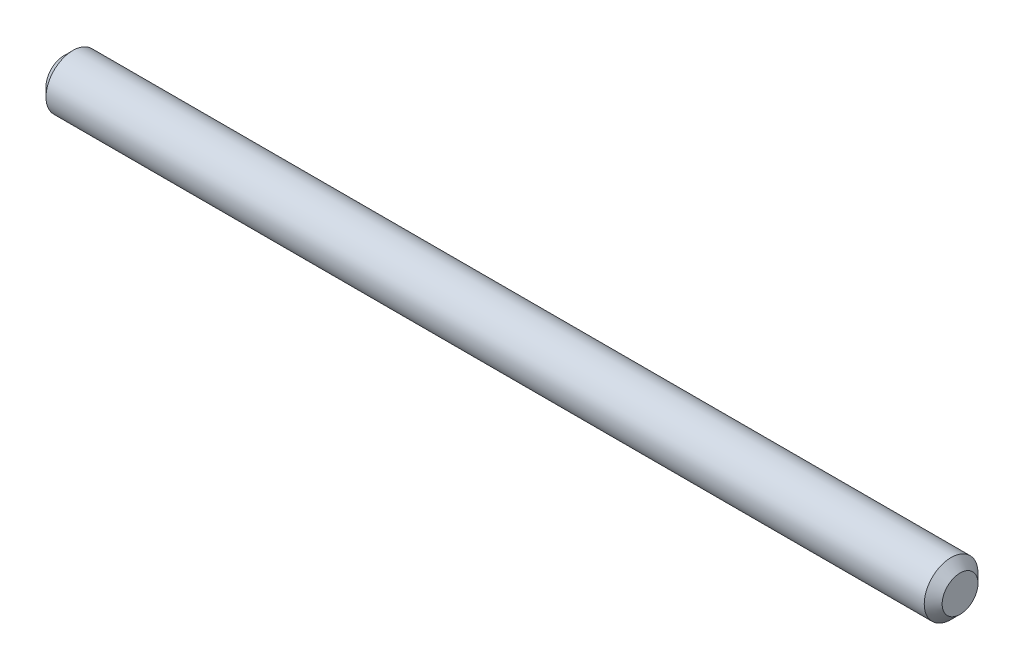
ISO-10303-21;
HEADER;
FILE_DESCRIPTION(('STEP AP214'),'2;1');
FILE_NAME('part.step','',(''),(''),'','','');
FILE_SCHEMA(('AUTOMOTIVE_DESIGN { 1 0 10303 214 1 1 1 1 }'));
ENDSEC;
DATA;
#1=APPLICATION_CONTEXT('core data for automotive mechanical design processes');
#2=APPLICATION_PROTOCOL_DEFINITION('international standard','automotive_design',2000,#1);
#3=PRODUCT_CONTEXT('',#1,'mechanical');
#4=PRODUCT('Part','Part','',(#3));
#5=PRODUCT_RELATED_PRODUCT_CATEGORY('part','',(#4));
#6=PRODUCT_DEFINITION_FORMATION('','',#4);
#7=PRODUCT_DEFINITION_CONTEXT('part definition',#1,'design');
#8=PRODUCT_DEFINITION('design','',#6,#7);
#9=PRODUCT_DEFINITION_SHAPE('','',#8);
#10=(LENGTH_UNIT() NAMED_UNIT(*) SI_UNIT(.MILLI.,.METRE.));
#11=(NAMED_UNIT(*) PLANE_ANGLE_UNIT() SI_UNIT($,.RADIAN.));
#12=(NAMED_UNIT(*) SI_UNIT($,.STERADIAN.) SOLID_ANGLE_UNIT());
#13=UNCERTAINTY_MEASURE_WITH_UNIT(LENGTH_MEASURE(1.E-05),#10,'distance_accuracy_value','');
#14=(GEOMETRIC_REPRESENTATION_CONTEXT(3) GLOBAL_UNCERTAINTY_ASSIGNED_CONTEXT((#13)) GLOBAL_UNIT_ASSIGNED_CONTEXT((#10,
#11,#12)) REPRESENTATION_CONTEXT('',''));
#15=CARTESIAN_POINT('',(0.,0.,0.));
#16=DIRECTION('',(0.,0.,1.));
#17=DIRECTION('',(1.,0.,0.));
#18=AXIS2_PLACEMENT_3D('',#15,#16,#17);
#19=CARTESIAN_POINT('',(0.,1.5,0.));
#20=DIRECTION('',(1.,0.,0.));
#21=DIRECTION('',(0.,0.,-1.));
#22=AXIS2_PLACEMENT_3D('',#19,#20,#21);
#23=PLANE('',#22);
#24=CARTESIAN_POINT('',(0.,0.,0.));
#25=DIRECTION('',(1.,0.,0.));
#26=DIRECTION('',(0.,0.,-1.));
#27=AXIS2_PLACEMENT_3D('',#24,#25,#26);
#28=CIRCLE('',#27,0.999999999999994);
#29=CARTESIAN_POINT('',(0.,0.,-0.999999999999994));
#30=VERTEX_POINT('',#29);
#31=EDGE_CURVE('E48',#30,#30,#28,.F.);
#32=ORIENTED_EDGE('',*,*,#31,.T.);
#33=EDGE_LOOP('',(#32));
#34=FACE_BOUND('',#33,.T.);
#35=ADVANCED_FACE('F33',(#34),#23,.F.);
#36=CARTESIAN_POINT('',(50.,0.,0.));
#37=DIRECTION('',(-1.,0.,0.));
#38=DIRECTION('',(0.,0.,1.));
#39=AXIS2_PLACEMENT_3D('',#36,#37,#38);
#40=PLANE('',#39);
#41=CARTESIAN_POINT('',(50.,0.,0.));
#42=DIRECTION('',(-1.,0.,0.));
#43=DIRECTION('',(0.,0.,1.));
#44=AXIS2_PLACEMENT_3D('',#41,#42,#43);
#45=CIRCLE('',#44,1.00000000000001);
#46=CARTESIAN_POINT('',(50.,0.,1.00000000000001));
#47=VERTEX_POINT('',#46);
#48=EDGE_CURVE('E10',#47,#47,#45,.F.);
#49=ORIENTED_EDGE('',*,*,#48,.T.);
#50=EDGE_LOOP('',(#49));
#51=FACE_BOUND('',#50,.T.);
#52=ADVANCED_FACE('F64',(#51),#40,.F.);
#53=CARTESIAN_POINT('',(0.,0.,0.));
#54=DIRECTION('',(-1.,0.,0.));
#55=DIRECTION('',(0.,0.,1.));
#56=AXIS2_PLACEMENT_3D('',#53,#54,#55);
#57=CYLINDRICAL_SURFACE('',#56,1.5);
#58=CARTESIAN_POINT('',(0.500000000000012,0.,0.));
#59=DIRECTION('',(1.,0.,0.));
#60=DIRECTION('',(0.,0.,-1.));
#61=AXIS2_PLACEMENT_3D('',#58,#59,#60);
#62=CIRCLE('',#61,1.5);
#63=CARTESIAN_POINT('',(0.500000000000012,0.,-1.5));
#64=VERTEX_POINT('',#63);
#65=EDGE_CURVE('E40',#64,#64,#62,.T.);
#66=ORIENTED_EDGE('',*,*,#65,.T.);
#67=EDGE_LOOP('',(#66));
#68=FACE_BOUND('',#67,.T.);
#69=CARTESIAN_POINT('',(49.5,0.,0.));
#70=DIRECTION('',(-1.,0.,0.));
#71=DIRECTION('',(0.,0.,1.));
#72=AXIS2_PLACEMENT_3D('',#69,#70,#71);
#73=CIRCLE('',#72,1.5);
#74=CARTESIAN_POINT('',(49.5,0.,1.5));
#75=VERTEX_POINT('',#74);
#76=EDGE_CURVE('E44',#75,#75,#73,.T.);
#77=ORIENTED_EDGE('',*,*,#76,.T.);
#78=EDGE_LOOP('',(#77));
#79=FACE_BOUND('',#78,.T.);
#80=ADVANCED_FACE('F57',(#68,#79),#57,.T.);
#81=CARTESIAN_POINT('',(0.,0.,0.));
#82=DIRECTION('',(1.,0.,0.));
#83=DIRECTION('',(0.,0.,-1.));
#84=AXIS2_PLACEMENT_3D('',#81,#82,#83);
#85=CONICAL_SURFACE('',#84,0.999999999999994,0.785398163397443);
#86=ORIENTED_EDGE('',*,*,#65,.F.);
#87=EDGE_LOOP('',(#86));
#88=FACE_BOUND('',#87,.T.);
#89=ORIENTED_EDGE('',*,*,#31,.F.);
#90=EDGE_LOOP('',(#89));
#91=FACE_BOUND('',#90,.T.);
#92=ADVANCED_FACE('F55',(#88,#91),#85,.T.);
#93=CARTESIAN_POINT('',(49.5,0.,0.));
#94=DIRECTION('',(-1.,0.,0.));
#95=DIRECTION('',(0.,0.,1.));
#96=AXIS2_PLACEMENT_3D('',#93,#94,#95);
#97=CONICAL_SURFACE('',#96,1.5,0.785398163397441);
#98=ORIENTED_EDGE('',*,*,#48,.F.);
#99=EDGE_LOOP('',(#98));
#100=FACE_BOUND('',#99,.T.);
#101=ORIENTED_EDGE('',*,*,#76,.F.);
#102=EDGE_LOOP('',(#101));
#103=FACE_BOUND('',#102,.T.);
#104=ADVANCED_FACE('F35',(#100,#103),#97,.T.);
#105=CLOSED_SHELL('',(#35,#52,#80,#92,#104));
#106=MANIFOLD_SOLID_BREP('B2',#105);
#107=ADVANCED_BREP_SHAPE_REPRESENTATION('',(#18,#106),#14);
#108=SHAPE_DEFINITION_REPRESENTATION(#9,#107);
ENDSEC;
END-ISO-10303-21;
